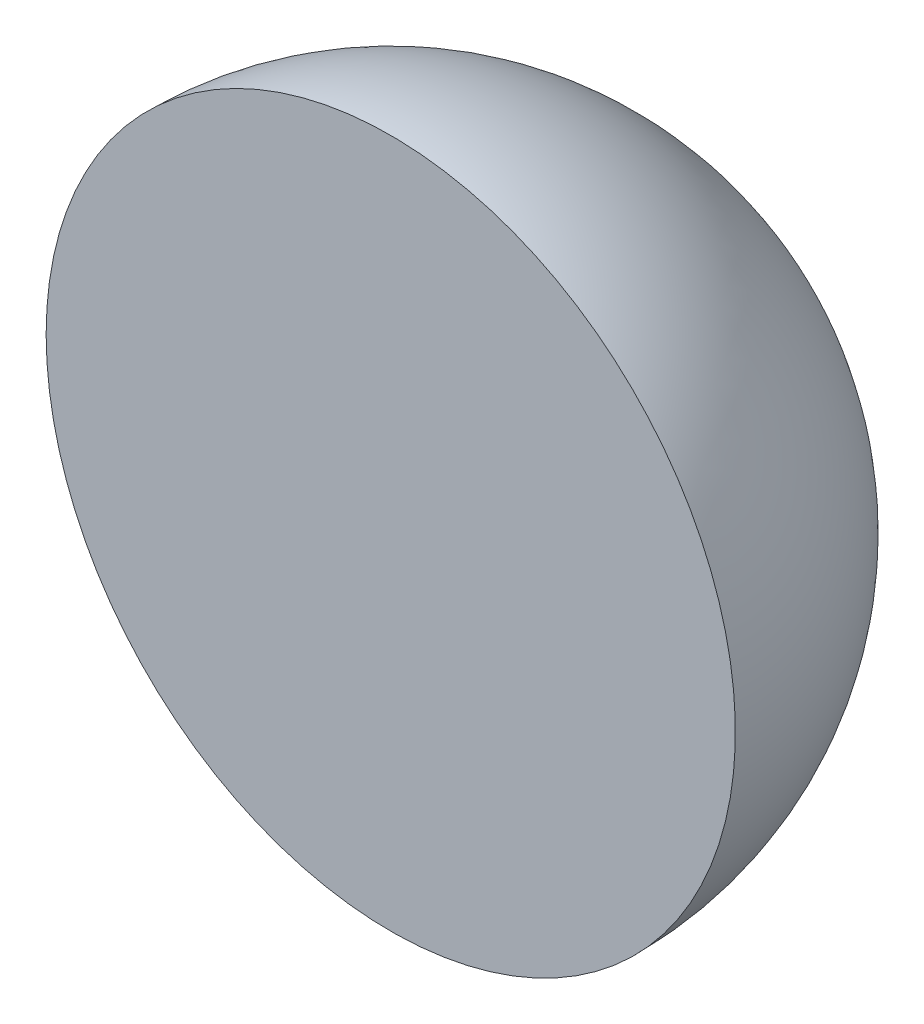
ISO-10303-21;
HEADER;
FILE_DESCRIPTION(('STEP AP214'),'2;1');
FILE_NAME('part.step','',(''),(''),'','','');
FILE_SCHEMA(('AUTOMOTIVE_DESIGN { 1 0 10303 214 1 1 1 1 }'));
ENDSEC;
DATA;
#1=APPLICATION_CONTEXT('core data for automotive mechanical design processes');
#2=APPLICATION_PROTOCOL_DEFINITION('international standard','automotive_design',2000,#1);
#3=PRODUCT_CONTEXT('',#1,'mechanical');
#4=PRODUCT('Part','Part','',(#3));
#5=PRODUCT_RELATED_PRODUCT_CATEGORY('part','',(#4));
#6=PRODUCT_DEFINITION_FORMATION('','',#4);
#7=PRODUCT_DEFINITION_CONTEXT('part definition',#1,'design');
#8=PRODUCT_DEFINITION('design','',#6,#7);
#9=PRODUCT_DEFINITION_SHAPE('','',#8);
#10=(LENGTH_UNIT() NAMED_UNIT(*) SI_UNIT(.MILLI.,.METRE.));
#11=(NAMED_UNIT(*) PLANE_ANGLE_UNIT() SI_UNIT($,.RADIAN.));
#12=(NAMED_UNIT(*) SI_UNIT($,.STERADIAN.) SOLID_ANGLE_UNIT());
#13=UNCERTAINTY_MEASURE_WITH_UNIT(LENGTH_MEASURE(1.E-05),#10,'distance_accuracy_value','');
#14=(GEOMETRIC_REPRESENTATION_CONTEXT(3) GLOBAL_UNCERTAINTY_ASSIGNED_CONTEXT((#13)) GLOBAL_UNIT_ASSIGNED_CONTEXT((#10,
#11,#12)) REPRESENTATION_CONTEXT('',''));
#15=CARTESIAN_POINT('',(0.,0.,0.));
#16=DIRECTION('',(0.,0.,1.));
#17=DIRECTION('',(1.,0.,0.));
#18=AXIS2_PLACEMENT_3D('',#15,#16,#17);
#19=CARTESIAN_POINT('',(0.,0.,0.));
#20=DIRECTION('',(0.,1.,0.));
#21=DIRECTION('',(-1.,0.,0.));
#22=AXIS2_PLACEMENT_3D('',#19,#20,#21);
#23=SPHERICAL_SURFACE('',#22,50.);
#24=CARTESIAN_POINT('',(0.,0.,0.));
#25=DIRECTION('',(0.,0.,-1.));
#26=DIRECTION('',(-1.,0.,0.));
#27=AXIS2_PLACEMENT_3D('',#24,#25,#26);
#28=SPHERICAL_SURFACE('',#27,50.);
#29=CARTESIAN_POINT('',(0.,0.,0.));
#30=DIRECTION('',(0.,0.,-1.));
#31=DIRECTION('',(-1.,0.,0.));
#32=AXIS2_PLACEMENT_3D('',#29,#30,#31);
#33=CIRCLE('',#32,50.);
#34=CARTESIAN_POINT('',(-50.,0.,-3.49148133884313E-13));
#35=VERTEX_POINT('',#34);
#36=EDGE_CURVE('E10',#35,#35,#33,.T.);
#37=ORIENTED_EDGE('',*,*,#36,.T.);
#38=EDGE_LOOP('',(#37));
#39=FACE_BOUND('',#38,.T.);
#40=ADVANCED_FACE('F31',(#39),#28,.T.);
#41=CARTESIAN_POINT('',(0.,0.,0.));
#42=DIRECTION('',(0.,0.,-1.));
#43=DIRECTION('',(-1.,0.,0.));
#44=AXIS2_PLACEMENT_3D('',#41,#42,#43);
#45=PLANE('',#44);
#46=ORIENTED_EDGE('',*,*,#36,.F.);
#47=EDGE_LOOP('',(#46));
#48=FACE_BOUND('',#47,.T.);
#49=ADVANCED_FACE('F39',(#48),#45,.F.);
#50=CLOSED_SHELL('',(#40,#49));
#51=MANIFOLD_SOLID_BREP('B2',#50);
#52=ADVANCED_BREP_SHAPE_REPRESENTATION('',(#18,#51),#14);
#53=SHAPE_DEFINITION_REPRESENTATION(#9,#52);
ENDSEC;
END-ISO-10303-21;
